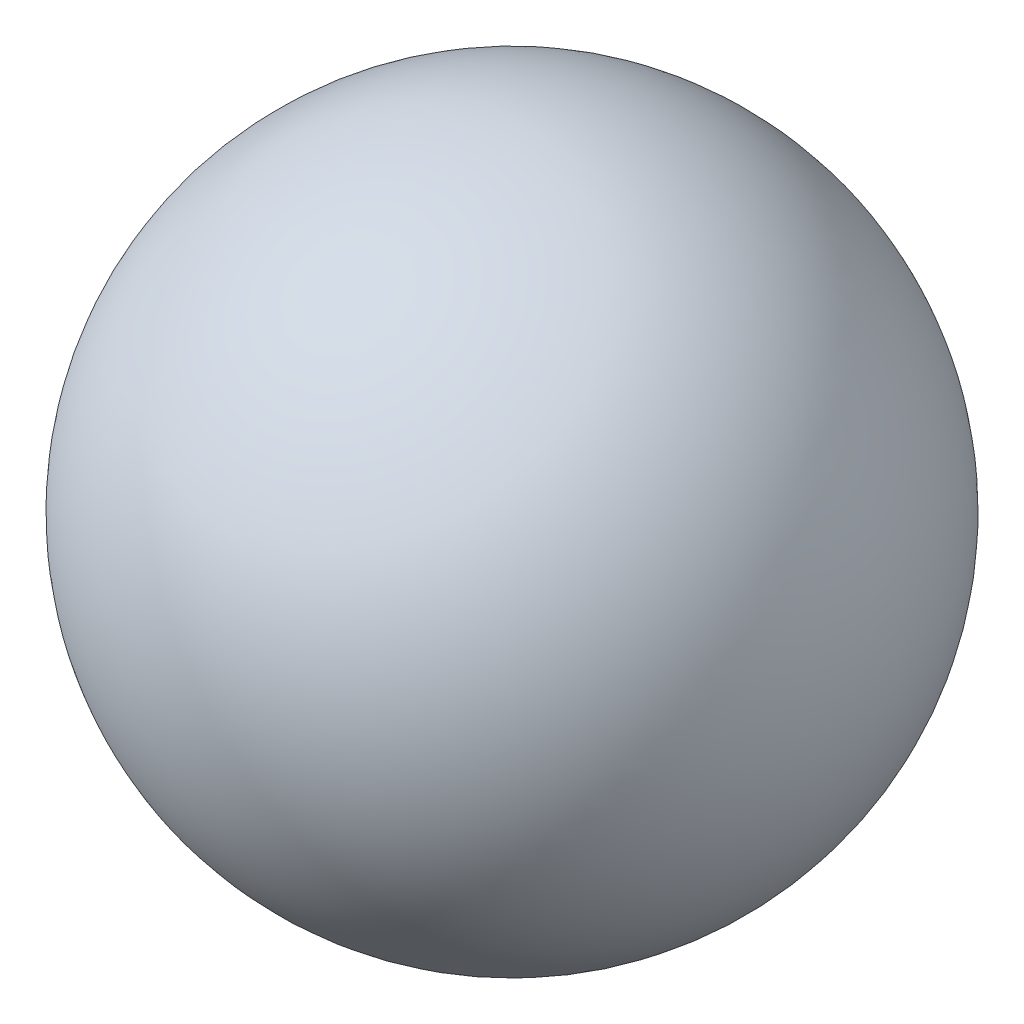
ISO-10303-21;
HEADER;
FILE_DESCRIPTION(('STEP AP214'),'2;1');
FILE_NAME('part.step','',(''),(''),'','','');
FILE_SCHEMA(('AUTOMOTIVE_DESIGN { 1 0 10303 214 1 1 1 1 }'));
ENDSEC;
DATA;
#1=APPLICATION_CONTEXT('core data for automotive mechanical design processes');
#2=APPLICATION_PROTOCOL_DEFINITION('international standard','automotive_design',2000,#1);
#3=PRODUCT_CONTEXT('',#1,'mechanical');
#4=PRODUCT('Part','Part','',(#3));
#5=PRODUCT_RELATED_PRODUCT_CATEGORY('part','',(#4));
#6=PRODUCT_DEFINITION_FORMATION('','',#4);
#7=PRODUCT_DEFINITION_CONTEXT('part definition',#1,'design');
#8=PRODUCT_DEFINITION('design','',#6,#7);
#9=PRODUCT_DEFINITION_SHAPE('','',#8);
#10=(LENGTH_UNIT() NAMED_UNIT(*) SI_UNIT(.MILLI.,.METRE.));
#11=(NAMED_UNIT(*) PLANE_ANGLE_UNIT() SI_UNIT($,.RADIAN.));
#12=(NAMED_UNIT(*) SI_UNIT($,.STERADIAN.) SOLID_ANGLE_UNIT());
#13=UNCERTAINTY_MEASURE_WITH_UNIT(LENGTH_MEASURE(1.E-05),#10,'distance_accuracy_value','');
#14=(GEOMETRIC_REPRESENTATION_CONTEXT(3) GLOBAL_UNCERTAINTY_ASSIGNED_CONTEXT((#13)) GLOBAL_UNIT_ASSIGNED_CONTEXT((#10,
#11,#12)) REPRESENTATION_CONTEXT('',''));
#15=CARTESIAN_POINT('',(0.,0.,0.));
#16=DIRECTION('',(0.,0.,1.));
#17=DIRECTION('',(1.,0.,0.));
#18=AXIS2_PLACEMENT_3D('',#15,#16,#17);
#19=CARTESIAN_POINT('',(2.22370212123478,-2.,11.5376621928368));
#20=DIRECTION('',(0.,0.,1.));
#21=DIRECTION('',(1.,0.,0.));
#22=AXIS2_PLACEMENT_3D('',#19,#20,#21);
#23=SPHERICAL_SURFACE('',#22,1.05);
#24=CARTESIAN_POINT('',(2.22370212123478,-2.,12.5876621928368));
#25=VERTEX_POINT('',#24);
#26=VERTEX_LOOP('',#25);
#27=FACE_BOUND('',#26,.T.);
#28=ADVANCED_FACE('F13',(#27),#23,.T.);
#29=CLOSED_SHELL('',(#28));
#30=MANIFOLD_SOLID_BREP('B1',#29);
#31=ADVANCED_BREP_SHAPE_REPRESENTATION('',(#18,#30),#14);
#32=SHAPE_DEFINITION_REPRESENTATION(#9,#31);
ENDSEC;
END-ISO-10303-21;
